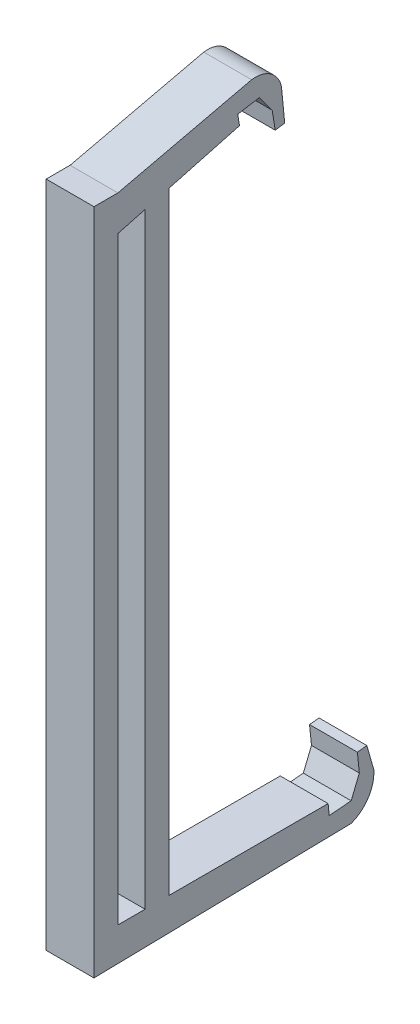
ISO-10303-21;
HEADER;
FILE_DESCRIPTION(('STEP AP214'),'2;1');
FILE_NAME('part.step','',(''),(''),'','','');
FILE_SCHEMA(('AUTOMOTIVE_DESIGN { 1 0 10303 214 1 1 1 1 }'));
ENDSEC;
DATA;
#1=APPLICATION_CONTEXT('core data for automotive mechanical design processes');
#2=APPLICATION_PROTOCOL_DEFINITION('international standard','automotive_design',2000,#1);
#3=PRODUCT_CONTEXT('',#1,'mechanical');
#4=PRODUCT('Part','Part','',(#3));
#5=PRODUCT_RELATED_PRODUCT_CATEGORY('part','',(#4));
#6=PRODUCT_DEFINITION_FORMATION('','',#4);
#7=PRODUCT_DEFINITION_CONTEXT('part definition',#1,'design');
#8=PRODUCT_DEFINITION('design','',#6,#7);
#9=PRODUCT_DEFINITION_SHAPE('','',#8);
#10=(LENGTH_UNIT() NAMED_UNIT(*) SI_UNIT(.MILLI.,.METRE.));
#11=(NAMED_UNIT(*) PLANE_ANGLE_UNIT() SI_UNIT($,.RADIAN.));
#12=(NAMED_UNIT(*) SI_UNIT($,.STERADIAN.) SOLID_ANGLE_UNIT());
#13=UNCERTAINTY_MEASURE_WITH_UNIT(LENGTH_MEASURE(1.E-05),#10,'distance_accuracy_value','');
#14=(GEOMETRIC_REPRESENTATION_CONTEXT(3) GLOBAL_UNCERTAINTY_ASSIGNED_CONTEXT((#13)) GLOBAL_UNIT_ASSIGNED_CONTEXT((#10,
#11,#12)) REPRESENTATION_CONTEXT('',''));
#15=CARTESIAN_POINT('',(0.,0.,0.));
#16=DIRECTION('',(0.,0.,1.));
#17=DIRECTION('',(1.,0.,0.));
#18=AXIS2_PLACEMENT_3D('',#15,#16,#17);
#19=CARTESIAN_POINT('',(24.9999996647239,6.19260203118666,-63.1998357811084));
#20=DIRECTION('',(0.,-0.0975174518776685,0.995233815030059));
#21=DIRECTION('',(0.,-0.995233815030059,-0.0975174518776685));
#22=AXIS2_PLACEMENT_3D('',#19,#20,#21);
#23=PLANE('',#22);
#24=DIRECTION('',(0.,0.995233815030059,0.0975174518776685));
#25=VECTOR('',#24,1.);
#26=CARTESIAN_POINT('',(14.9999996647239,6.19260203118666,-63.1998357811084));
#27=LINE('',#26,#25);
#28=CARTESIAN_POINT('',(14.9999996647239,349.581092596054,-29.5530986040831));
#29=VERTEX_POINT('',#28);
#30=CARTESIAN_POINT('',(14.9999996647239,356.511801481247,-28.8739968091249));
#31=VERTEX_POINT('',#30);
#32=EDGE_CURVE('E251',#29,#31,#27,.T.);
#33=ORIENTED_EDGE('',*,*,#32,.T.);
#34=DIRECTION('',(-1.,0.,0.));
#35=VECTOR('',#34,1.);
#36=CARTESIAN_POINT('',(24.9999996647239,356.511801481247,-28.8739968091249));
#37=LINE('',#36,#35);
#38=CARTESIAN_POINT('',(24.9999996647239,356.511801481247,-28.8739968091249));
#39=VERTEX_POINT('',#38);
#40=EDGE_CURVE('E11',#39,#31,#37,.T.);
#41=ORIENTED_EDGE('',*,*,#40,.F.);
#42=DIRECTION('',(0.,0.995233815030059,0.0975174518776685));
#43=VECTOR('',#42,1.);
#44=CARTESIAN_POINT('',(24.9999996647239,6.19260203118666,-63.1998357811084));
#45=LINE('',#44,#43);
#46=CARTESIAN_POINT('',(24.9999996647239,349.581092596054,-29.5530986040831));
#47=VERTEX_POINT('',#46);
#48=EDGE_CURVE('E368',#47,#39,#45,.T.);
#49=ORIENTED_EDGE('',*,*,#48,.F.);
#50=DIRECTION('',(-1.,0.,0.));
#51=VECTOR('',#50,1.);
#52=CARTESIAN_POINT('',(24.9999996647239,349.581092596054,-29.5530986040831));
#53=LINE('',#52,#51);
#54=EDGE_CURVE('E306',#47,#29,#53,.T.);
#55=ORIENTED_EDGE('',*,*,#54,.T.);
#56=EDGE_LOOP('',(#33,#41,#49,#55));
#57=FACE_BOUND('',#56,.T.);
#58=ADVANCED_FACE('F37',(#57),#23,.F.);
#59=CARTESIAN_POINT('',(24.9999996647239,355.366193485786,-23.4274375844478));
#60=DIRECTION('',(-1.,0.,0.));
#61=DIRECTION('',(0.,0.,1.));
#62=AXIS2_PLACEMENT_3D('',#59,#60,#61);
#63=CYLINDRICAL_SURFACE('',#62,5.56573670480192);
#64=CARTESIAN_POINT('',(14.9999996647239,355.366193485786,-23.4274375844478));
#65=DIRECTION('',(1.,0.,0.));
#66=DIRECTION('',(0.,0.,-1.));
#67=AXIS2_PLACEMENT_3D('',#64,#65,#66);
#68=CIRCLE('',#67,5.56573670480192);
#69=CARTESIAN_POINT('',(14.9999996647239,360.875427722931,-22.6363856345415));
#70=VERTEX_POINT('',#69);
#71=EDGE_CURVE('E254',#31,#70,#68,.T.);
#72=ORIENTED_EDGE('',*,*,#71,.T.);
#73=DIRECTION('',(-1.,0.,0.));
#74=VECTOR('',#73,1.);
#75=CARTESIAN_POINT('',(24.9999996647239,360.875427722931,-22.6363856345415));
#76=LINE('',#75,#74);
#77=CARTESIAN_POINT('',(24.9999996647239,360.875427722931,-22.6363856345415));
#78=VERTEX_POINT('',#77);
#79=EDGE_CURVE('E47',#78,#70,#76,.T.);
#80=ORIENTED_EDGE('',*,*,#79,.F.);
#81=CARTESIAN_POINT('',(24.9999996647239,355.366193485786,-23.4274375844478));
#82=DIRECTION('',(1.,0.,0.));
#83=DIRECTION('',(0.,0.,-1.));
#84=AXIS2_PLACEMENT_3D('',#81,#82,#83);
#85=CIRCLE('',#84,5.56573670480192);
#86=EDGE_CURVE('E370',#39,#78,#85,.T.);
#87=ORIENTED_EDGE('',*,*,#86,.F.);
#88=ORIENTED_EDGE('',*,*,#40,.T.);
#89=EDGE_LOOP('',(#72,#80,#87,#88));
#90=FACE_BOUND('',#89,.T.);
#91=ADVANCED_FACE('F444',(#90),#63,.T.);
#92=CARTESIAN_POINT('',(24.9999996647239,337.313382537043,78.5477887875131));
#93=DIRECTION('',(0.,0.973942489910796,0.226795119758691));
#94=DIRECTION('',(0.,-0.226795119758691,0.973942489910796));
#95=AXIS2_PLACEMENT_3D('',#92,#93,#94);
#96=PLANE('',#95);
#97=DIRECTION('',(0.,0.226795119758691,-0.973942489910796));
#98=VECTOR('',#97,1.);
#99=CARTESIAN_POINT('',(14.9999996647239,337.313382537043,78.5477887875131));
#100=LINE('',#99,#98);
#101=CARTESIAN_POINT('',(14.9999996647239,354.369103908539,5.30418567359447));
#102=VERTEX_POINT('',#101);
#103=EDGE_CURVE('E257',#102,#70,#100,.T.);
#104=ORIENTED_EDGE('',*,*,#103,.F.);
#105=DIRECTION('',(-1.,0.,0.));
#106=VECTOR('',#105,1.);
#107=CARTESIAN_POINT('',(24.9999996647239,354.369103908539,5.30418567359447));
#108=LINE('',#107,#106);
#109=CARTESIAN_POINT('',(24.9999996647239,354.369103908539,5.30418567359447));
#110=VERTEX_POINT('',#109);
#111=EDGE_CURVE('E340',#110,#102,#108,.T.);
#112=ORIENTED_EDGE('',*,*,#111,.F.);
#113=DIRECTION('',(0.,0.226795119758691,-0.973942489910796));
#114=VECTOR('',#113,1.);
#115=CARTESIAN_POINT('',(24.9999996647239,337.313382537043,78.5477887875131));
#116=LINE('',#115,#114);
#117=EDGE_CURVE('E376',#110,#78,#116,.T.);
#118=ORIENTED_EDGE('',*,*,#117,.T.);
#119=ORIENTED_EDGE('',*,*,#79,.T.);
#120=EDGE_LOOP('',(#104,#112,#118,#119));
#121=FACE_BOUND('',#120,.T.);
#122=ADVANCED_FACE('F449',(#121),#96,.T.);
#123=CARTESIAN_POINT('',(24.9999996647239,354.369103908539,0.));
#124=DIRECTION('',(0.,1.,0.));
#125=DIRECTION('',(0.,0.,1.));
#126=AXIS2_PLACEMENT_3D('',#123,#124,#125);
#127=PLANE('',#126);
#128=DIRECTION('',(0.,0.,-1.));
#129=VECTOR('',#128,1.);
#130=CARTESIAN_POINT('',(14.9999996647239,354.369103908539,0.));
#131=LINE('',#130,#129);
#132=CARTESIAN_POINT('',(14.9999996647239,354.369103908539,10.3041855618358));
#133=VERTEX_POINT('',#132);
#134=EDGE_CURVE('E260',#133,#102,#131,.T.);
#135=ORIENTED_EDGE('',*,*,#134,.F.);
#136=DIRECTION('',(-1.,0.,0.));
#137=VECTOR('',#136,1.);
#138=CARTESIAN_POINT('',(24.9999996647239,354.369103908539,10.3041855618358));
#139=LINE('',#138,#137);
#140=CARTESIAN_POINT('',(24.9999996647239,354.369103908539,10.3041855618358));
#141=VERTEX_POINT('',#140);
#142=EDGE_CURVE('E338',#141,#133,#139,.T.);
#143=ORIENTED_EDGE('',*,*,#142,.F.);
#144=DIRECTION('',(0.,0.,-1.));
#145=VECTOR('',#144,1.);
#146=CARTESIAN_POINT('',(24.9999996647239,354.369103908539,0.));
#147=LINE('',#146,#145);
#148=EDGE_CURVE('E379',#141,#110,#147,.T.);
#149=ORIENTED_EDGE('',*,*,#148,.T.);
#150=ORIENTED_EDGE('',*,*,#111,.T.);
#151=EDGE_LOOP('',(#135,#143,#149,#150));
#152=FACE_BOUND('',#151,.T.);
#153=ADVANCED_FACE('F518',(#152),#127,.T.);
#154=CARTESIAN_POINT('',(24.9999996647239,0.,10.3041855618358));
#155=DIRECTION('',(0.,0.,1.));
#156=DIRECTION('',(1.,0.,0.));
#157=AXIS2_PLACEMENT_3D('',#154,#155,#156);
#158=PLANE('',#157);
#159=DIRECTION('',(0.,1.,0.));
#160=VECTOR('',#159,1.);
#161=CARTESIAN_POINT('',(14.9999996647239,0.,10.3041855618358));
#162=LINE('',#161,#160);
#163=CARTESIAN_POINT('',(14.9999996647239,214.764729142189,10.3041855618358));
#164=VERTEX_POINT('',#163);
#165=EDGE_CURVE('E263',#164,#133,#162,.T.);
#166=ORIENTED_EDGE('',*,*,#165,.F.);
#167=DIRECTION('',(-1.,0.,0.));
#168=VECTOR('',#167,1.);
#169=CARTESIAN_POINT('',(24.9999996647239,214.764729142189,10.3041855618358));
#170=LINE('',#169,#168);
#171=CARTESIAN_POINT('',(24.9999996647239,214.764729142189,10.3041855618358));
#172=VERTEX_POINT('',#171);
#173=EDGE_CURVE('E336',#172,#164,#170,.T.);
#174=ORIENTED_EDGE('',*,*,#173,.F.);
#175=DIRECTION('',(0.,1.,0.));
#176=VECTOR('',#175,1.);
#177=CARTESIAN_POINT('',(24.9999996647239,0.,10.3041855618358));
#178=LINE('',#177,#176);
#179=EDGE_CURVE('E382',#172,#141,#178,.T.);
#180=ORIENTED_EDGE('',*,*,#179,.T.);
#181=ORIENTED_EDGE('',*,*,#142,.T.);
#182=EDGE_LOOP('',(#166,#174,#180,#181));
#183=FACE_BOUND('',#182,.T.);
#184=ADVANCED_FACE('F514',(#183),#158,.T.);
#185=CARTESIAN_POINT('',(24.9999996647239,214.885807560587,4.42681606984083));
#186=DIRECTION('',(0.,-0.99978787136971,-0.0205964138146421));
#187=DIRECTION('',(0.,0.0205964138146421,-0.99978787136971));
#188=AXIS2_PLACEMENT_3D('',#185,#186,#187);
#189=PLANE('',#188);
#190=DIRECTION('',(0.,-0.0205964138146421,0.99978787136971));
#191=VECTOR('',#190,1.);
#192=CARTESIAN_POINT('',(14.9999996647239,214.885807560587,4.42681606984083));
#193=LINE('',#192,#191);
#194=CARTESIAN_POINT('',(14.9999996647239,215.872973203659,-43.4920229017735));
#195=VERTEX_POINT('',#194);
#196=EDGE_CURVE('E266',#195,#164,#193,.T.);
#197=ORIENTED_EDGE('',*,*,#196,.F.);
#198=DIRECTION('',(-1.,0.,0.));
#199=VECTOR('',#198,1.);
#200=CARTESIAN_POINT('',(24.9999996647239,215.872973203659,-43.4920229017735));
#201=LINE('',#200,#199);
#202=CARTESIAN_POINT('',(24.9999996647239,215.872973203659,-43.4920229017735));
#203=VERTEX_POINT('',#202);
#204=EDGE_CURVE('E334',#203,#195,#201,.T.);
#205=ORIENTED_EDGE('',*,*,#204,.F.);
#206=DIRECTION('',(0.,-0.0205964138146421,0.99978787136971));
#207=VECTOR('',#206,1.);
#208=CARTESIAN_POINT('',(24.9999996647239,214.885807560587,4.42681606984083));
#209=LINE('',#208,#207);
#210=EDGE_CURVE('E385',#203,#172,#209,.T.);
#211=ORIENTED_EDGE('',*,*,#210,.T.);
#212=ORIENTED_EDGE('',*,*,#173,.T.);
#213=EDGE_LOOP('',(#197,#205,#211,#212));
#214=FACE_BOUND('',#213,.T.);
#215=ADVANCED_FACE('F510',(#214),#189,.T.);
#216=CARTESIAN_POINT('',(24.9999996647239,222.672370867096,-40.9167771207064));
#217=DIRECTION('',(-1.,0.,0.));
#218=DIRECTION('',(0.,0.,1.));
#219=AXIS2_PLACEMENT_3D('',#216,#217,#218);
#220=CYLINDRICAL_SURFACE('',#219,7.27074270060897);
#221=CARTESIAN_POINT('',(14.9999996647239,222.672370867096,-40.9167771207064));
#222=DIRECTION('',(1.,0.,0.));
#223=DIRECTION('',(0.,0.,-1.));
#224=AXIS2_PLACEMENT_3D('',#221,#222,#223);
#225=CIRCLE('',#224,7.27074270060897);
#226=CARTESIAN_POINT('',(14.9999996647239,223.266988992691,-48.1631644070148));
#227=VERTEX_POINT('',#226);
#228=EDGE_CURVE('E269',#195,#227,#225,.T.);
#229=ORIENTED_EDGE('',*,*,#228,.T.);
#230=DIRECTION('',(-1.,0.,0.));
#231=VECTOR('',#230,1.);
#232=CARTESIAN_POINT('',(24.9999996647239,223.266988992691,-48.1631644070148));
#233=LINE('',#232,#231);
#234=CARTESIAN_POINT('',(24.9999996647239,223.266988992691,-48.1631644070148));
#235=VERTEX_POINT('',#234);
#236=EDGE_CURVE('E332',#235,#227,#233,.T.);
#237=ORIENTED_EDGE('',*,*,#236,.F.);
#238=CARTESIAN_POINT('',(24.9999996647239,222.672370867096,-40.9167771207064));
#239=DIRECTION('',(1.,0.,0.));
#240=DIRECTION('',(0.,0.,-1.));
#241=AXIS2_PLACEMENT_3D('',#238,#239,#240);
#242=CIRCLE('',#241,7.27074270060897);
#243=EDGE_CURVE('E388',#203,#235,#242,.T.);
#244=ORIENTED_EDGE('',*,*,#243,.F.);
#245=ORIENTED_EDGE('',*,*,#204,.T.);
#246=EDGE_LOOP('',(#229,#237,#244,#245));
#247=FACE_BOUND('',#246,.T.);
#248=ADVANCED_FACE('F506',(#247),#220,.T.);
#249=CARTESIAN_POINT('',(24.9999996647239,29.2322091734047,-103.151095114725));
#250=DIRECTION('',(0.,0.272654942588762,-0.962111886571369));
#251=DIRECTION('',(0.,0.962111886571369,0.272654942588762));
#252=AXIS2_PLACEMENT_3D('',#249,#250,#251);
#253=PLANE('',#252);
#254=DIRECTION('',(0.,-0.962111886571369,-0.272654942588762));
#255=VECTOR('',#254,1.);
#256=CARTESIAN_POINT('',(14.9999996647239,29.2322091734047,-103.151095114725));
#257=LINE('',#256,#255);
#258=CARTESIAN_POINT('',(14.9999996647239,228.31828892231,-46.7316657304764));
#259=VERTEX_POINT('',#258);
#260=EDGE_CURVE('E272',#259,#227,#257,.T.);
#261=ORIENTED_EDGE('',*,*,#260,.F.);
#262=DIRECTION('',(-1.,0.,0.));
#263=VECTOR('',#262,1.);
#264=CARTESIAN_POINT('',(24.9999996647239,228.31828892231,-46.7316657304764));
#265=LINE('',#264,#263);
#266=CARTESIAN_POINT('',(24.9999996647239,228.31828892231,-46.7316657304764));
#267=VERTEX_POINT('',#266);
#268=EDGE_CURVE('E330',#267,#259,#265,.T.);
#269=ORIENTED_EDGE('',*,*,#268,.F.);
#270=DIRECTION('',(0.,-0.962111886571369,-0.272654942588762));
#271=VECTOR('',#270,1.);
#272=CARTESIAN_POINT('',(24.9999996647239,29.2322091734047,-103.151095114725));
#273=LINE('',#272,#271);
#274=EDGE_CURVE('E390',#267,#235,#273,.T.);
#275=ORIENTED_EDGE('',*,*,#274,.T.);
#276=ORIENTED_EDGE('',*,*,#236,.T.);
#277=EDGE_LOOP('',(#261,#269,#275,#276));
#278=FACE_BOUND('',#277,.T.);
#279=ADVANCED_FACE('F502',(#278),#253,.T.);
#280=CARTESIAN_POINT('',(24.9999996647239,221.2886264155,22.4767947403285));
#281=DIRECTION('',(0.,0.994881108503746,0.101052362378905));
#282=DIRECTION('',(0.,-0.101052362378905,0.994881108503746));
#283=AXIS2_PLACEMENT_3D('',#280,#281,#282);
#284=PLANE('',#283);
#285=DIRECTION('',(0.,0.101052362378905,-0.994881108503746));
#286=VECTOR('',#285,1.);
#287=CARTESIAN_POINT('',(14.9999996647239,221.2886264155,22.4767947403285));
#288=LINE('',#287,#286);
#289=CARTESIAN_POINT('',(14.9999996647239,228.116184473038,-44.7419062256813));
#290=VERTEX_POINT('',#289);
#291=EDGE_CURVE('E275',#290,#259,#288,.T.);
#292=ORIENTED_EDGE('',*,*,#291,.F.);
#293=DIRECTION('',(-1.,0.,0.));
#294=VECTOR('',#293,1.);
#295=CARTESIAN_POINT('',(24.9999996647239,228.116184473038,-44.7419062256813));
#296=LINE('',#295,#294);
#297=CARTESIAN_POINT('',(24.9999996647239,228.116184473038,-44.7419062256813));
#298=VERTEX_POINT('',#297);
#299=EDGE_CURVE('E328',#298,#290,#296,.T.);
#300=ORIENTED_EDGE('',*,*,#299,.F.);
#301=DIRECTION('',(0.,0.101052362378905,-0.994881108503746));
#302=VECTOR('',#301,1.);
#303=CARTESIAN_POINT('',(24.9999996647239,221.2886264155,22.4767947403285));
#304=LINE('',#303,#302);
#305=EDGE_CURVE('E393',#298,#267,#304,.T.);
#306=ORIENTED_EDGE('',*,*,#305,.T.);
#307=ORIENTED_EDGE('',*,*,#268,.T.);
#308=EDGE_LOOP('',(#292,#300,#306,#307));
#309=FACE_BOUND('',#308,.T.);
#310=ADVANCED_FACE('F498',(#309),#284,.T.);
#311=CARTESIAN_POINT('',(24.9999996647239,6.82785672461324,-67.2194150694386));
#312=DIRECTION('',(0.,-0.101055675096152,0.994880772017864));
#313=DIRECTION('',(0.,-0.994880772017864,-0.101055675096152));
#314=AXIS2_PLACEMENT_3D('',#311,#312,#313);
#315=PLANE('',#314);
#316=DIRECTION('',(0.,0.994880772017864,0.101055675096152));
#317=VECTOR('',#316,1.);
#318=CARTESIAN_POINT('',(14.9999996647239,6.82785672461324,-67.2194150694386));
#319=LINE('',#318,#317);
#320=CARTESIAN_POINT('',(14.9999996647239,224.136650562286,-45.1461300253868));
#321=VERTEX_POINT('',#320);
#322=EDGE_CURVE('E278',#321,#290,#319,.T.);
#323=ORIENTED_EDGE('',*,*,#322,.F.);
#324=DIRECTION('',(-1.,0.,0.));
#325=VECTOR('',#324,1.);
#326=CARTESIAN_POINT('',(24.9999996647239,224.136650562286,-45.1461300253868));
#327=LINE('',#326,#325);
#328=CARTESIAN_POINT('',(24.9999996647239,224.136650562286,-45.1461300253868));
#329=VERTEX_POINT('',#328);
#330=EDGE_CURVE('E326',#329,#321,#327,.T.);
#331=ORIENTED_EDGE('',*,*,#330,.F.);
#332=DIRECTION('',(0.,0.994880772017864,0.101055675096152));
#333=VECTOR('',#332,1.);
#334=CARTESIAN_POINT('',(24.9999996647239,6.82785672461324,-67.2194150694386));
#335=LINE('',#334,#333);
#336=EDGE_CURVE('E396',#329,#298,#335,.T.);
#337=ORIENTED_EDGE('',*,*,#336,.T.);
#338=ORIENTED_EDGE('',*,*,#299,.T.);
#339=EDGE_LOOP('',(#323,#331,#337,#338));
#340=FACE_BOUND('',#339,.T.);
#341=ADVANCED_FACE('F494',(#340),#315,.T.);
#342=CARTESIAN_POINT('',(24.9999996647239,16.2049160625946,39.7090316795703));
#343=DIRECTION('',(0.,0.377839995362222,0.925870907796911));
#344=DIRECTION('',(0.,-0.925870907796911,0.377839995362222));
#345=AXIS2_PLACEMENT_3D('',#342,#343,#344);
#346=PLANE('',#345);
#347=DIRECTION('',(0.,0.925870907796911,-0.377839995362222));
#348=VECTOR('',#347,1.);
#349=CARTESIAN_POINT('',(14.9999996647239,16.2049160625946,39.7090316795703));
#350=LINE('',#349,#348);
#351=CARTESIAN_POINT('',(14.9999996647239,219.970226287842,-43.445847928524));
#352=VERTEX_POINT('',#351);
#353=EDGE_CURVE('E281',#352,#321,#350,.T.);
#354=ORIENTED_EDGE('',*,*,#353,.F.);
#355=DIRECTION('',(-1.,0.,0.));
#356=VECTOR('',#355,1.);
#357=CARTESIAN_POINT('',(24.9999996647239,219.970226287842,-43.445847928524));
#358=LINE('',#357,#356);
#359=CARTESIAN_POINT('',(24.9999996647239,219.970226287842,-43.445847928524));
#360=VERTEX_POINT('',#359);
#361=EDGE_CURVE('E324',#360,#352,#358,.T.);
#362=ORIENTED_EDGE('',*,*,#361,.F.);
#363=DIRECTION('',(0.,0.925870907796911,-0.377839995362222));
#364=VECTOR('',#363,1.);
#365=CARTESIAN_POINT('',(24.9999996647239,16.2049160625946,39.7090316795703));
#366=LINE('',#365,#364);
#367=EDGE_CURVE('E399',#360,#329,#366,.T.);
#368=ORIENTED_EDGE('',*,*,#367,.T.);
#369=ORIENTED_EDGE('',*,*,#330,.T.);
#370=EDGE_LOOP('',(#354,#362,#368,#369));
#371=FACE_BOUND('',#370,.T.);
#372=ADVANCED_FACE('F490',(#371),#346,.T.);
#373=CARTESIAN_POINT('',(24.9999996647239,214.807459858737,18.0374352901151));
#374=DIRECTION('',(0.,0.996493033737821,0.0836757653803866));
#375=DIRECTION('',(0.,-0.0836757653803866,0.996493033737821));
#376=AXIS2_PLACEMENT_3D('',#373,#374,#375);
#377=PLANE('',#376);
#378=DIRECTION('',(0.,0.0836757653803866,-0.996493033737821));
#379=VECTOR('',#378,1.);
#380=CARTESIAN_POINT('',(14.9999996647239,214.807459858737,18.0374352901151));
#381=LINE('',#380,#379);
#382=CARTESIAN_POINT('',(14.9999996647239,219.584763050079,-38.8553738594055));
#383=VERTEX_POINT('',#382);
#384=EDGE_CURVE('E284',#383,#352,#381,.T.);
#385=ORIENTED_EDGE('',*,*,#384,.F.);
#386=DIRECTION('',(-1.,0.,0.));
#387=VECTOR('',#386,1.);
#388=CARTESIAN_POINT('',(24.9999996647239,219.584763050079,-38.8553738594055));
#389=LINE('',#388,#387);
#390=CARTESIAN_POINT('',(24.9999996647239,219.584763050079,-38.8553738594055));
#391=VERTEX_POINT('',#390);
#392=EDGE_CURVE('E322',#391,#383,#389,.T.);
#393=ORIENTED_EDGE('',*,*,#392,.F.);
#394=DIRECTION('',(0.,0.0836757653803866,-0.996493033737821));
#395=VECTOR('',#394,1.);
#396=CARTESIAN_POINT('',(24.9999996647239,214.807459858737,18.0374352901151));
#397=LINE('',#396,#395);
#398=EDGE_CURVE('E402',#391,#360,#397,.T.);
#399=ORIENTED_EDGE('',*,*,#398,.T.);
#400=ORIENTED_EDGE('',*,*,#361,.T.);
#401=EDGE_LOOP('',(#385,#393,#399,#400));
#402=FACE_BOUND('',#401,.T.);
#403=ADVANCED_FACE('F486',(#402),#377,.T.);
#404=CARTESIAN_POINT('',(24.9999996647239,6.14893122065399,-60.5353172357755));
#405=DIRECTION('',(0.,0.101055938168329,-0.994880745296098));
#406=DIRECTION('',(0.,0.994880745296098,0.101055938168329));
#407=AXIS2_PLACEMENT_3D('',#404,#405,#406);
#408=PLANE('',#407);
#409=DIRECTION('',(0.,-0.994880745296098,-0.101055938168329));
#410=VECTOR('',#409,1.);
#411=CARTESIAN_POINT('',(14.9999996647239,6.14893122065399,-60.5353172357755));
#412=LINE('',#411,#410);
#413=CARTESIAN_POINT('',(14.9999996647239,221.872985363007,-38.6229455471039));
#414=VERTEX_POINT('',#413);
#415=EDGE_CURVE('E287',#414,#383,#412,.T.);
#416=ORIENTED_EDGE('',*,*,#415,.F.);
#417=DIRECTION('',(-1.,0.,0.));
#418=VECTOR('',#417,1.);
#419=CARTESIAN_POINT('',(24.9999996647239,221.872985363007,-38.6229455471039));
#420=LINE('',#419,#418);
#421=CARTESIAN_POINT('',(24.9999996647239,221.872985363007,-38.6229455471039));
#422=VERTEX_POINT('',#421);
#423=EDGE_CURVE('E320',#422,#414,#420,.T.);
#424=ORIENTED_EDGE('',*,*,#423,.F.);
#425=DIRECTION('',(0.,-0.994880745296098,-0.101055938168329));
#426=VECTOR('',#425,1.);
#427=CARTESIAN_POINT('',(24.9999996647239,6.14893122065399,-60.5353172357755));
#428=LINE('',#427,#426);
#429=EDGE_CURVE('E405',#422,#391,#428,.T.);
#430=ORIENTED_EDGE('',*,*,#429,.T.);
#431=ORIENTED_EDGE('',*,*,#392,.T.);
#432=EDGE_LOOP('',(#416,#424,#430,#431));
#433=FACE_BOUND('',#432,.T.);
#434=ADVANCED_FACE('F482',(#433),#408,.T.);
#435=CARTESIAN_POINT('',(24.9999996647239,221.872985363007,0.));
#436=DIRECTION('',(0.,1.,0.));
#437=DIRECTION('',(0.,0.,1.));
#438=AXIS2_PLACEMENT_3D('',#435,#436,#437);
#439=PLANE('',#438);
#440=DIRECTION('',(0.,0.,-1.));
#441=VECTOR('',#440,1.);
#442=CARTESIAN_POINT('',(14.9999996647239,221.872985363007,0.));
#443=LINE('',#442,#441);
#444=CARTESIAN_POINT('',(14.9999996647239,221.872985363007,-5.37294475361705));
#445=VERTEX_POINT('',#444);
#446=EDGE_CURVE('E290',#445,#414,#443,.T.);
#447=ORIENTED_EDGE('',*,*,#446,.F.);
#448=DIRECTION('',(-1.,0.,0.));
#449=VECTOR('',#448,1.);
#450=CARTESIAN_POINT('',(24.9999996647239,221.872985363007,-5.37294475361705));
#451=LINE('',#450,#449);
#452=CARTESIAN_POINT('',(24.9999996647239,221.872985363007,-5.37294475361705));
#453=VERTEX_POINT('',#452);
#454=EDGE_CURVE('E318',#453,#445,#451,.T.);
#455=ORIENTED_EDGE('',*,*,#454,.F.);
#456=DIRECTION('',(0.,0.,-1.));
#457=VECTOR('',#456,1.);
#458=CARTESIAN_POINT('',(24.9999996647239,221.872985363007,0.));
#459=LINE('',#458,#457);
#460=EDGE_CURVE('E408',#453,#422,#459,.T.);
#461=ORIENTED_EDGE('',*,*,#460,.T.);
#462=ORIENTED_EDGE('',*,*,#423,.T.);
#463=EDGE_LOOP('',(#447,#455,#461,#462));
#464=FACE_BOUND('',#463,.T.);
#465=ADVANCED_FACE('F478',(#464),#439,.T.);
#466=CARTESIAN_POINT('',(24.9999996647239,1.95466634289126E-08,-5.37294556078632));
#467=DIRECTION('',(0.,3.63797905781348E-09,-1.));
#468=DIRECTION('',(0.,1.,3.63797905781348E-09));
#469=AXIS2_PLACEMENT_3D('',#466,#467,#468);
#470=PLANE('',#469);
#471=DIRECTION('',(0.,-1.,-3.63797905781348E-09));
#472=VECTOR('',#471,1.);
#473=CARTESIAN_POINT('',(14.9999996647239,1.95466634289126E-08,-5.37294556078632));
#474=LINE('',#473,#472);
#475=CARTESIAN_POINT('',(14.9999996647239,349.872976541519,-5.37294428795576));
#476=VERTEX_POINT('',#475);
#477=EDGE_CURVE('E293',#476,#445,#474,.T.);
#478=ORIENTED_EDGE('',*,*,#477,.F.);
#479=DIRECTION('',(-1.,0.,0.));
#480=VECTOR('',#479,1.);
#481=CARTESIAN_POINT('',(24.9999996647239,349.872976541519,-5.37294428795576));
#482=LINE('',#481,#480);
#483=CARTESIAN_POINT('',(24.9999996647239,349.872976541519,-5.37294428795576));
#484=VERTEX_POINT('',#483);
#485=EDGE_CURVE('E316',#484,#476,#482,.T.);
#486=ORIENTED_EDGE('',*,*,#485,.F.);
#487=DIRECTION('',(0.,-1.,-3.63797905781348E-09));
#488=VECTOR('',#487,1.);
#489=CARTESIAN_POINT('',(24.9999996647239,1.95466634289126E-08,-5.37294556078632));
#490=LINE('',#489,#488);
#491=EDGE_CURVE('E411',#484,#453,#490,.T.);
#492=ORIENTED_EDGE('',*,*,#491,.T.);
#493=ORIENTED_EDGE('',*,*,#454,.T.);
#494=EDGE_LOOP('',(#478,#486,#492,#493));
#495=FACE_BOUND('',#494,.T.);
#496=ADVANCED_FACE('F474',(#495),#470,.T.);
#497=CARTESIAN_POINT('',(24.9999996647239,325.092702297589,87.1083130621514));
#498=DIRECTION('',(0.,0.965925836676301,0.258819006336839));
#499=DIRECTION('',(0.,-0.258819006336839,0.965925836676301));
#500=AXIS2_PLACEMENT_3D('',#497,#498,#499);
#501=PLANE('',#500);
#502=DIRECTION('',(0.,0.258819006336839,-0.965925836676301));
#503=VECTOR('',#502,1.);
#504=CARTESIAN_POINT('',(14.9999996647239,325.092702297589,87.1083130621514));
#505=LINE('',#504,#503);
#506=CARTESIAN_POINT('',(14.9999996647239,353.819966316223,-20.1033130288124));
#507=VERTEX_POINT('',#506);
#508=EDGE_CURVE('E296',#476,#507,#505,.T.);
#509=ORIENTED_EDGE('',*,*,#508,.T.);
#510=DIRECTION('',(-1.,0.,0.));
#511=VECTOR('',#510,1.);
#512=CARTESIAN_POINT('',(24.9999996647239,353.819966316223,-20.1033130288124));
#513=LINE('',#512,#511);
#514=CARTESIAN_POINT('',(24.9999996647239,353.819966316223,-20.1033130288124));
#515=VERTEX_POINT('',#514);
#516=EDGE_CURVE('E313',#515,#507,#513,.T.);
#517=ORIENTED_EDGE('',*,*,#516,.F.);
#518=DIRECTION('',(0.,0.258819006336839,-0.965925836676301));
#519=VECTOR('',#518,1.);
#520=CARTESIAN_POINT('',(24.9999996647239,325.092702297589,87.1083130621514));
#521=LINE('',#520,#519);
#522=EDGE_CURVE('E414',#484,#515,#521,.T.);
#523=ORIENTED_EDGE('',*,*,#522,.F.);
#524=ORIENTED_EDGE('',*,*,#485,.T.);
#525=EDGE_LOOP('',(#509,#517,#523,#524));
#526=FACE_BOUND('',#525,.T.);
#527=ADVANCED_FACE('F471',(#526),#501,.F.);
#528=CARTESIAN_POINT('',(24.9999996647239,12.2170082434696,-75.4305671313018));
#529=DIRECTION('',(0.,-0.159880195906452,0.987136425706657));
#530=DIRECTION('',(0.,-0.987136425706657,-0.159880195906452));
#531=AXIS2_PLACEMENT_3D('',#528,#529,#530);
#532=PLANE('',#531);
#533=DIRECTION('',(0.,0.987136425706657,0.159880195906452));
#534=VECTOR('',#533,1.);
#535=CARTESIAN_POINT('',(14.9999996647239,12.2170082434696,-75.4305671313018));
#536=LINE('',#535,#534);
#537=CARTESIAN_POINT('',(14.9999996647239,356.090396642685,-19.7355858981609));
#538=VERTEX_POINT('',#537);
#539=EDGE_CURVE('E298',#507,#538,#536,.T.);
#540=ORIENTED_EDGE('',*,*,#539,.T.);
#541=DIRECTION('',(-1.,0.,0.));
#542=VECTOR('',#541,1.);
#543=CARTESIAN_POINT('',(24.9999996647239,356.090396642685,-19.7355858981609));
#544=LINE('',#543,#542);
#545=CARTESIAN_POINT('',(24.9999996647239,356.090396642685,-19.7355858981609));
#546=VERTEX_POINT('',#545);
#547=EDGE_CURVE('E310',#546,#538,#544,.T.);
#548=ORIENTED_EDGE('',*,*,#547,.F.);
#549=DIRECTION('',(0.,0.987136425706657,0.159880195906452));
#550=VECTOR('',#549,1.);
#551=CARTESIAN_POINT('',(24.9999996647239,12.2170082434696,-75.4305671313018));
#552=LINE('',#551,#550);
#553=EDGE_CURVE('E416',#515,#546,#552,.T.);
#554=ORIENTED_EDGE('',*,*,#553,.F.);
#555=ORIENTED_EDGE('',*,*,#516,.T.);
#556=EDGE_LOOP('',(#540,#548,#554,#555));
#557=FACE_BOUND('',#556,.T.);
#558=ADVANCED_FACE('F423',(#557),#532,.F.);
#559=CARTESIAN_POINT('',(24.9999996647239,343.57347193421,56.4485445381168));
#560=DIRECTION('',(0.,0.986770278088812,0.162124699785472));
#561=DIRECTION('',(0.,-0.162124699785472,0.986770278088812));
#562=AXIS2_PLACEMENT_3D('',#559,#560,#561);
#563=PLANE('',#562);
#564=DIRECTION('',(0.,0.162124699785472,-0.986770278088812));
#565=VECTOR('',#564,1.);
#566=CARTESIAN_POINT('',(14.9999996647239,343.57347193421,56.4485445381168));
#567=LINE('',#566,#565);
#568=CARTESIAN_POINT('',(14.9999996647239,356.836169958115,-24.2747273296118));
#569=VERTEX_POINT('',#568);
#570=EDGE_CURVE('E300',#538,#569,#567,.T.);
#571=ORIENTED_EDGE('',*,*,#570,.T.);
#572=DIRECTION('',(-1.,0.,0.));
#573=VECTOR('',#572,1.);
#574=CARTESIAN_POINT('',(24.9999996647239,356.836169958115,-24.2747273296118));
#575=LINE('',#574,#573);
#576=CARTESIAN_POINT('',(24.9999996647239,356.836169958115,-24.2747273296118));
#577=VERTEX_POINT('',#576);
#578=EDGE_CURVE('E230',#577,#569,#575,.T.);
#579=ORIENTED_EDGE('',*,*,#578,.F.);
#580=DIRECTION('',(0.,0.162124699785472,-0.986770278088812));
#581=VECTOR('',#580,1.);
#582=CARTESIAN_POINT('',(24.9999996647239,343.57347193421,56.4485445381168));
#583=LINE('',#582,#581);
#584=EDGE_CURVE('E221',#546,#577,#583,.T.);
#585=ORIENTED_EDGE('',*,*,#584,.F.);
#586=ORIENTED_EDGE('',*,*,#547,.T.);
#587=EDGE_LOOP('',(#571,#579,#585,#586));
#588=FACE_BOUND('',#587,.T.);
#589=ADVANCED_FACE('F427',(#588),#563,.F.);
#590=CARTESIAN_POINT('',(24.9999996647239,136.695644683157,-186.032638528963));
#591=DIRECTION('',(0.,0.592128770286325,-0.80584335909605));
#592=DIRECTION('',(0.,0.80584335909605,0.592128770286324));
#593=AXIS2_PLACEMENT_3D('',#590,#591,#592);
#594=PLANE('',#593);
#595=DIRECTION('',(0.,-0.80584335909605,-0.592128770286325));
#596=VECTOR('',#595,1.);
#597=CARTESIAN_POINT('',(14.9999996647239,136.695644683157,-186.032638528963));
#598=LINE('',#597,#596);
#599=CARTESIAN_POINT('',(14.9999996647239,353.209882974625,-26.9393008202314));
#600=VERTEX_POINT('',#599);
#601=EDGE_CURVE('E229',#569,#600,#598,.T.);
#602=ORIENTED_EDGE('',*,*,#601,.T.);
#603=DIRECTION('',(-1.,0.,0.));
#604=VECTOR('',#603,1.);
#605=CARTESIAN_POINT('',(24.9999996647239,353.209882974625,-26.9393008202314));
#606=LINE('',#605,#604);
#607=CARTESIAN_POINT('',(24.9999996647239,353.209882974625,-26.9393008202314));
#608=VERTEX_POINT('',#607);
#609=EDGE_CURVE('E226',#608,#600,#606,.T.);
#610=ORIENTED_EDGE('',*,*,#609,.F.);
#611=DIRECTION('',(0.,-0.80584335909605,-0.592128770286325));
#612=VECTOR('',#611,1.);
#613=CARTESIAN_POINT('',(24.9999996647239,136.695644683157,-186.032638528963));
#614=LINE('',#613,#612);
#615=EDGE_CURVE('E215',#577,#608,#614,.T.);
#616=ORIENTED_EDGE('',*,*,#615,.F.);
#617=ORIENTED_EDGE('',*,*,#578,.T.);
#618=EDGE_LOOP('',(#602,#610,#616,#617));
#619=FACE_BOUND('',#618,.T.);
#620=ADVANCED_FACE('F227',(#619),#594,.F.);
#621=CARTESIAN_POINT('',(24.9999996647239,13.2803464983155,-81.995656506983));
#622=DIRECTION('',(0.,0.159880577962072,-0.987136363827467));
#623=DIRECTION('',(0.,0.987136363827467,0.159880577962072));
#624=AXIS2_PLACEMENT_3D('',#621,#622,#623);
#625=PLANE('',#624);
#626=DIRECTION('',(0.,-0.987136363827467,-0.159880577962072));
#627=VECTOR('',#626,1.);
#628=CARTESIAN_POINT('',(14.9999996647239,13.2803464983155,-81.995656506983));
#629=LINE('',#628,#627);
#630=CARTESIAN_POINT('',(14.9999996647239,349.261313676834,-27.5788269937039));
#631=VERTEX_POINT('',#630);
#632=EDGE_CURVE('E136',#600,#631,#629,.T.);
#633=ORIENTED_EDGE('',*,*,#632,.T.);
#634=DIRECTION('',(-1.,0.,0.));
#635=VECTOR('',#634,1.);
#636=CARTESIAN_POINT('',(24.9999996647239,349.261313676834,-27.5788269937039));
#637=LINE('',#636,#635);
#638=CARTESIAN_POINT('',(24.9999996647239,349.261313676834,-27.5788269937039));
#639=VERTEX_POINT('',#638);
#640=EDGE_CURVE('E231',#639,#631,#637,.T.);
#641=ORIENTED_EDGE('',*,*,#640,.F.);
#642=DIRECTION('',(0.,-0.987136363827467,-0.159880577962072));
#643=VECTOR('',#642,1.);
#644=CARTESIAN_POINT('',(24.9999996647239,13.2803464983155,-81.995656506983));
#645=LINE('',#644,#643);
#646=EDGE_CURVE('E219',#608,#639,#645,.T.);
#647=ORIENTED_EDGE('',*,*,#646,.F.);
#648=ORIENTED_EDGE('',*,*,#609,.T.);
#649=EDGE_LOOP('',(#633,#641,#647,#648));
#650=FACE_BOUND('',#649,.T.);
#651=ADVANCED_FACE('F233',(#650),#625,.F.);
#652=CARTESIAN_POINT('',(24.9999996647239,221.872985363007,0.));
#653=DIRECTION('',(0.,1.,0.));
#654=DIRECTION('',(0.,0.,1.));
#655=AXIS2_PLACEMENT_3D('',#652,#653,#654);
#656=PLANE('',#655);
#657=DIRECTION('',(0.,0.,-1.));
#658=VECTOR('',#657,1.);
#659=CARTESIAN_POINT('',(14.9999996647239,221.872985363007,0.));
#660=LINE('',#659,#658);
#661=CARTESIAN_POINT('',(14.9999996647239,221.872985363007,5.30418556183575));
#662=VERTEX_POINT('',#661);
#663=CARTESIAN_POINT('',(14.9999996647239,221.872985363007,-0.372943822294505));
#664=VERTEX_POINT('',#663);
#665=EDGE_CURVE('E239',#662,#664,#660,.T.);
#666=ORIENTED_EDGE('',*,*,#665,.F.);
#667=DIRECTION('',(-1.,0.,0.));
#668=VECTOR('',#667,1.);
#669=CARTESIAN_POINT('',(24.9999996647239,221.872985363007,5.30418556183575));
#670=LINE('',#669,#668);
#671=CARTESIAN_POINT('',(24.9999996647239,221.872985363007,5.30418556183575));
#672=VERTEX_POINT('',#671);
#673=EDGE_CURVE('E41',#672,#662,#670,.T.);
#674=ORIENTED_EDGE('',*,*,#673,.F.);
#675=DIRECTION('',(0.,0.,-1.));
#676=VECTOR('',#675,1.);
#677=CARTESIAN_POINT('',(24.9999996647239,221.872985363007,0.));
#678=LINE('',#677,#676);
#679=CARTESIAN_POINT('',(24.9999996647239,221.872985363007,-0.372943822294505));
#680=VERTEX_POINT('',#679);
#681=EDGE_CURVE('E305',#672,#680,#678,.T.);
#682=ORIENTED_EDGE('',*,*,#681,.T.);
#683=DIRECTION('',(-1.,0.,0.));
#684=VECTOR('',#683,1.);
#685=CARTESIAN_POINT('',(24.9999996647239,221.872985363007,-0.372943822294505));
#686=LINE('',#685,#684);
#687=EDGE_CURVE('E235',#680,#664,#686,.T.);
#688=ORIENTED_EDGE('',*,*,#687,.T.);
#689=EDGE_LOOP('',(#666,#674,#682,#688));
#690=FACE_BOUND('',#689,.T.);
#691=ADVANCED_FACE('F39',(#690),#656,.T.);
#692=CARTESIAN_POINT('',(24.9999996647239,0.,5.30418556183572));
#693=DIRECTION('',(0.,0.,-1.));
#694=DIRECTION('',(0.,1.,0.));
#695=AXIS2_PLACEMENT_3D('',#692,#693,#694);
#696=PLANE('',#695);
#697=DIRECTION('',(0.,-1.,0.));
#698=VECTOR('',#697,1.);
#699=CARTESIAN_POINT('',(14.9999996647239,0.,5.30418556183572));
#700=LINE('',#699,#698);
#701=CARTESIAN_POINT('',(14.9999996647239,347.012048680058,5.30418556183577));
#702=VERTEX_POINT('',#701);
#703=EDGE_CURVE('E242',#702,#662,#700,.T.);
#704=ORIENTED_EDGE('',*,*,#703,.F.);
#705=DIRECTION('',(-1.,0.,0.));
#706=VECTOR('',#705,1.);
#707=CARTESIAN_POINT('',(24.9999996647239,347.012048680058,5.30418556183577));
#708=LINE('',#707,#706);
#709=CARTESIAN_POINT('',(24.9999996647239,347.012048680058,5.30418556183577));
#710=VERTEX_POINT('',#709);
#711=EDGE_CURVE('E345',#710,#702,#708,.T.);
#712=ORIENTED_EDGE('',*,*,#711,.F.);
#713=DIRECTION('',(0.,-1.,0.));
#714=VECTOR('',#713,1.);
#715=CARTESIAN_POINT('',(24.9999996647239,0.,5.30418556183572));
#716=LINE('',#715,#714);
#717=EDGE_CURVE('E354',#710,#672,#716,.T.);
#718=ORIENTED_EDGE('',*,*,#717,.T.);
#719=ORIENTED_EDGE('',*,*,#673,.T.);
#720=EDGE_LOOP('',(#704,#712,#718,#719));
#721=FACE_BOUND('',#720,.T.);
#722=ADVANCED_FACE('F352',(#721),#696,.T.);
#723=CARTESIAN_POINT('',(24.9999996647239,325.092702297589,87.1083130621523));
#724=DIRECTION('',(0.,0.9659258366763,0.258819006336841));
#725=DIRECTION('',(0.,-0.258819006336841,0.9659258366763));
#726=AXIS2_PLACEMENT_3D('',#723,#724,#725);
#727=PLANE('',#726);
#728=DIRECTION('',(0.,0.258819006336841,-0.9659258366763));
#729=VECTOR('',#728,1.);
#730=CARTESIAN_POINT('',(14.9999996647239,325.092702297589,87.1083130621523));
#731=LINE('',#730,#729);
#732=CARTESIAN_POINT('',(14.9999996647239,348.533230669663,-0.372943822294505));
#733=VERTEX_POINT('',#732);
#734=EDGE_CURVE('E245',#702,#733,#731,.T.);
#735=ORIENTED_EDGE('',*,*,#734,.T.);
#736=DIRECTION('',(-1.,0.,0.));
#737=VECTOR('',#736,1.);
#738=CARTESIAN_POINT('',(24.9999996647239,348.533230669663,-0.372943822294505));
#739=LINE('',#738,#737);
#740=CARTESIAN_POINT('',(24.9999996647239,348.533230669663,-0.372943822294505));
#741=VERTEX_POINT('',#740);
#742=EDGE_CURVE('E344',#741,#733,#739,.T.);
#743=ORIENTED_EDGE('',*,*,#742,.F.);
#744=DIRECTION('',(0.,0.258819006336841,-0.9659258366763));
#745=VECTOR('',#744,1.);
#746=CARTESIAN_POINT('',(24.9999996647239,325.092702297589,87.1083130621523));
#747=LINE('',#746,#745);
#748=EDGE_CURVE('E362',#710,#741,#747,.T.);
#749=ORIENTED_EDGE('',*,*,#748,.F.);
#750=ORIENTED_EDGE('',*,*,#711,.T.);
#751=EDGE_LOOP('',(#735,#743,#749,#750));
#752=FACE_BOUND('',#751,.T.);
#753=ADVANCED_FACE('F360',(#752),#727,.F.);
#754=CARTESIAN_POINT('',(24.9999996647239,0.,-0.372943822294505));
#755=DIRECTION('',(0.,0.,1.));
#756=DIRECTION('',(1.,0.,0.));
#757=AXIS2_PLACEMENT_3D('',#754,#755,#756);
#758=PLANE('',#757);
#759=DIRECTION('',(0.,1.,0.));
#760=VECTOR('',#759,1.);
#761=CARTESIAN_POINT('',(14.9999996647239,0.,-0.372943822294505));
#762=LINE('',#761,#760);
#763=EDGE_CURVE('E248',#664,#733,#762,.T.);
#764=ORIENTED_EDGE('',*,*,#763,.F.);
#765=ORIENTED_EDGE('',*,*,#687,.F.);
#766=DIRECTION('',(0.,1.,0.));
#767=VECTOR('',#766,1.);
#768=CARTESIAN_POINT('',(24.9999996647239,0.,-0.372943822294505));
#769=LINE('',#768,#767);
#770=EDGE_CURVE('E365',#680,#741,#769,.T.);
#771=ORIENTED_EDGE('',*,*,#770,.T.);
#772=ORIENTED_EDGE('',*,*,#742,.T.);
#773=EDGE_LOOP('',(#764,#765,#771,#772));
#774=FACE_BOUND('',#773,.T.);
#775=ADVANCED_FACE('F366',(#774),#758,.T.);
#776=CARTESIAN_POINT('',(24.9999996647239,335.979758988021,54.4196875668686));
#777=DIRECTION('',(0.,0.987134947773593,0.159889320731644));
#778=DIRECTION('',(0.,-0.159889320731644,0.987134947773593));
#779=AXIS2_PLACEMENT_3D('',#776,#777,#778);
#780=PLANE('',#779);
#781=DIRECTION('',(0.,0.159889320731644,-0.987134947773593));
#782=VECTOR('',#781,1.);
#783=CARTESIAN_POINT('',(14.9999996647239,335.979758988021,54.4196875668686));
#784=LINE('',#783,#782);
#785=EDGE_CURVE('E142',#631,#29,#784,.T.);
#786=ORIENTED_EDGE('',*,*,#785,.T.);
#787=ORIENTED_EDGE('',*,*,#54,.F.);
#788=DIRECTION('',(0.,0.159889320731644,-0.987134947773593));
#789=VECTOR('',#788,1.);
#790=CARTESIAN_POINT('',(24.9999996647239,335.979758988021,54.4196875668686));
#791=LINE('',#790,#789);
#792=EDGE_CURVE('E56',#639,#47,#791,.T.);
#793=ORIENTED_EDGE('',*,*,#792,.F.);
#794=ORIENTED_EDGE('',*,*,#640,.T.);
#795=EDGE_LOOP('',(#786,#787,#793,#794));
#796=FACE_BOUND('',#795,.T.);
#797=ADVANCED_FACE('F432',(#796),#780,.F.);
#798=CARTESIAN_POINT('',(24.9999996647239,0.,0.));
#799=DIRECTION('',(1.,0.,0.));
#800=DIRECTION('',(0.,0.,-1.));
#801=AXIS2_PLACEMENT_3D('',#798,#799,#800);
#802=PLANE('',#801);
#803=ORIENTED_EDGE('',*,*,#681,.F.);
#804=ORIENTED_EDGE('',*,*,#717,.F.);
#805=ORIENTED_EDGE('',*,*,#748,.T.);
#806=ORIENTED_EDGE('',*,*,#770,.F.);
#807=EDGE_LOOP('',(#803,#804,#805,#806));
#808=FACE_BOUND('',#807,.T.);
#809=ORIENTED_EDGE('',*,*,#48,.T.);
#810=ORIENTED_EDGE('',*,*,#86,.T.);
#811=ORIENTED_EDGE('',*,*,#117,.F.);
#812=ORIENTED_EDGE('',*,*,#148,.F.);
#813=ORIENTED_EDGE('',*,*,#179,.F.);
#814=ORIENTED_EDGE('',*,*,#210,.F.);
#815=ORIENTED_EDGE('',*,*,#243,.T.);
#816=ORIENTED_EDGE('',*,*,#274,.F.);
#817=ORIENTED_EDGE('',*,*,#305,.F.);
#818=ORIENTED_EDGE('',*,*,#336,.F.);
#819=ORIENTED_EDGE('',*,*,#367,.F.);
#820=ORIENTED_EDGE('',*,*,#398,.F.);
#821=ORIENTED_EDGE('',*,*,#429,.F.);
#822=ORIENTED_EDGE('',*,*,#460,.F.);
#823=ORIENTED_EDGE('',*,*,#491,.F.);
#824=ORIENTED_EDGE('',*,*,#522,.T.);
#825=ORIENTED_EDGE('',*,*,#553,.T.);
#826=ORIENTED_EDGE('',*,*,#584,.T.);
#827=ORIENTED_EDGE('',*,*,#615,.T.);
#828=ORIENTED_EDGE('',*,*,#646,.T.);
#829=ORIENTED_EDGE('',*,*,#792,.T.);
#830=EDGE_LOOP('',(#809,#810,#811,#812,#813,#814,#815,#816,#817,#818,#819,#820,#821,#822,#823,
#824,#825,#826,#827,#828,#829));
#831=FACE_BOUND('',#830,.T.);
#832=ADVANCED_FACE('F217',(#808,#831),#802,.T.);
#833=CARTESIAN_POINT('',(14.9999996647239,0.,0.));
#834=DIRECTION('',(1.,0.,0.));
#835=DIRECTION('',(0.,0.,-1.));
#836=AXIS2_PLACEMENT_3D('',#833,#834,#835);
#837=PLANE('',#836);
#838=ORIENTED_EDGE('',*,*,#665,.T.);
#839=ORIENTED_EDGE('',*,*,#763,.T.);
#840=ORIENTED_EDGE('',*,*,#734,.F.);
#841=ORIENTED_EDGE('',*,*,#703,.T.);
#842=EDGE_LOOP('',(#838,#839,#840,#841));
#843=FACE_BOUND('',#842,.T.);
#844=ORIENTED_EDGE('',*,*,#32,.F.);
#845=ORIENTED_EDGE('',*,*,#785,.F.);
#846=ORIENTED_EDGE('',*,*,#632,.F.);
#847=ORIENTED_EDGE('',*,*,#601,.F.);
#848=ORIENTED_EDGE('',*,*,#570,.F.);
#849=ORIENTED_EDGE('',*,*,#539,.F.);
#850=ORIENTED_EDGE('',*,*,#508,.F.);
#851=ORIENTED_EDGE('',*,*,#477,.T.);
#852=ORIENTED_EDGE('',*,*,#446,.T.);
#853=ORIENTED_EDGE('',*,*,#415,.T.);
#854=ORIENTED_EDGE('',*,*,#384,.T.);
#855=ORIENTED_EDGE('',*,*,#353,.T.);
#856=ORIENTED_EDGE('',*,*,#322,.T.);
#857=ORIENTED_EDGE('',*,*,#291,.T.);
#858=ORIENTED_EDGE('',*,*,#260,.T.);
#859=ORIENTED_EDGE('',*,*,#228,.F.);
#860=ORIENTED_EDGE('',*,*,#196,.T.);
#861=ORIENTED_EDGE('',*,*,#165,.T.);
#862=ORIENTED_EDGE('',*,*,#134,.T.);
#863=ORIENTED_EDGE('',*,*,#103,.T.);
#864=ORIENTED_EDGE('',*,*,#71,.F.);
#865=EDGE_LOOP('',(#844,#845,#846,#847,#848,#849,#850,#851,#852,#853,#854,#855,#856,#857,#858,
#859,#860,#861,#862,#863,#864));
#866=FACE_BOUND('',#865,.T.);
#867=ADVANCED_FACE('F357',(#843,#866),#837,.F.);
#868=CLOSED_SHELL('',(#58,#91,#122,#153,#184,#215,#248,#279,#310,#341,#372,#403,#434,#465,#496,
#527,#558,#589,#620,#651,#691,#722,#753,#775,#797,#832,#867));
#869=MANIFOLD_SOLID_BREP('B2',#868);
#870=ADVANCED_BREP_SHAPE_REPRESENTATION('',(#18,#869),#14);
#871=SHAPE_DEFINITION_REPRESENTATION(#9,#870);
ENDSEC;
END-ISO-10303-21;
